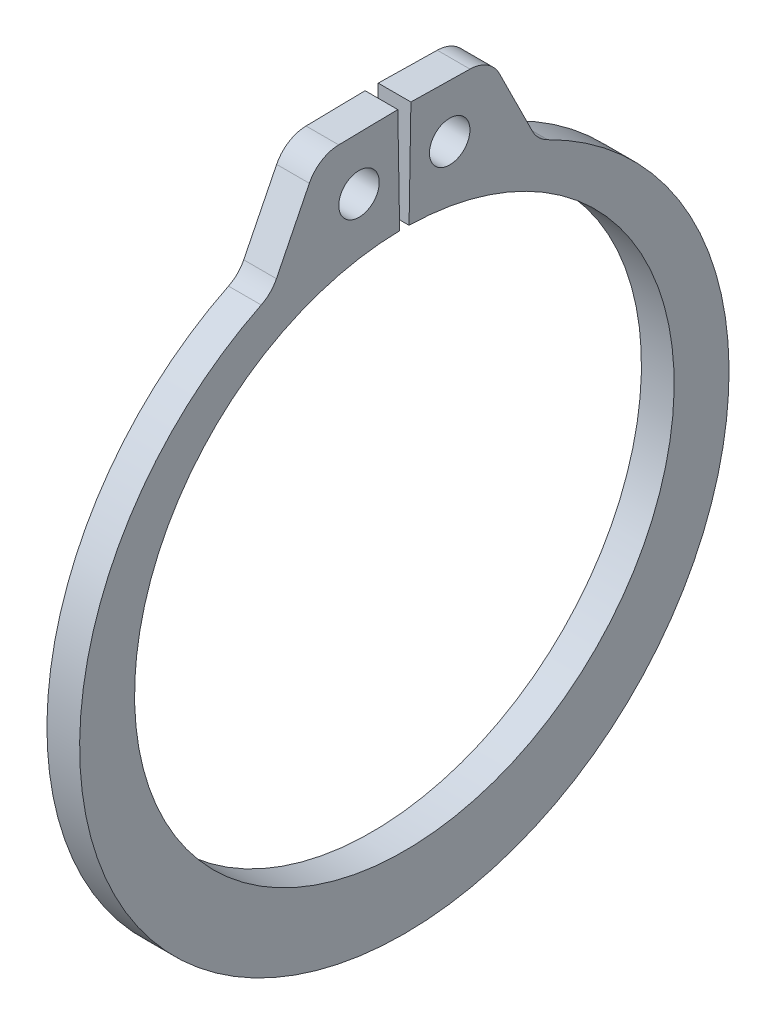
ISO-10303-21;
HEADER;
FILE_DESCRIPTION(('STEP AP214'),'2;1');
FILE_NAME('part.step','',(''),(''),'','','');
FILE_SCHEMA(('AUTOMOTIVE_DESIGN { 1 0 10303 214 1 1 1 1 }'));
ENDSEC;
DATA;
#1=APPLICATION_CONTEXT('core data for automotive mechanical design processes');
#2=APPLICATION_PROTOCOL_DEFINITION('international standard','automotive_design',2000,#1);
#3=PRODUCT_CONTEXT('',#1,'mechanical');
#4=PRODUCT('Part','Part','',(#3));
#5=PRODUCT_RELATED_PRODUCT_CATEGORY('part','',(#4));
#6=PRODUCT_DEFINITION_FORMATION('','',#4);
#7=PRODUCT_DEFINITION_CONTEXT('part definition',#1,'design');
#8=PRODUCT_DEFINITION('design','',#6,#7);
#9=PRODUCT_DEFINITION_SHAPE('','',#8);
#10=(LENGTH_UNIT() NAMED_UNIT(*) SI_UNIT(.MILLI.,.METRE.));
#11=(NAMED_UNIT(*) PLANE_ANGLE_UNIT() SI_UNIT($,.RADIAN.));
#12=(NAMED_UNIT(*) SI_UNIT($,.STERADIAN.) SOLID_ANGLE_UNIT());
#13=UNCERTAINTY_MEASURE_WITH_UNIT(LENGTH_MEASURE(1.E-05),#10,'distance_accuracy_value','');
#14=(GEOMETRIC_REPRESENTATION_CONTEXT(3) GLOBAL_UNCERTAINTY_ASSIGNED_CONTEXT((#13)) GLOBAL_UNIT_ASSIGNED_CONTEXT((#10,
#11,#12)) REPRESENTATION_CONTEXT('',''));
#15=CARTESIAN_POINT('',(0.,0.,0.));
#16=DIRECTION('',(0.,0.,1.));
#17=DIRECTION('',(1.,0.,0.));
#18=AXIS2_PLACEMENT_3D('',#15,#16,#17);
#19=CARTESIAN_POINT('',(0.533399999999989,0.,0.));
#20=DIRECTION('',(1.,0.,0.));
#21=DIRECTION('',(0.,0.,-1.));
#22=AXIS2_PLACEMENT_3D('',#19,#20,#21);
#23=PLANE('',#22);
#24=CARTESIAN_POINT('',(0.533399999999989,10.5040886416162,-1.47894687499924));
#25=DIRECTION('',(-1.,0.,0.));
#26=DIRECTION('',(0.,0.,1.));
#27=AXIS2_PLACEMENT_3D('',#24,#25,#26);
#28=CIRCLE('',#27,0.6604);
#29=CARTESIAN_POINT('',(0.533399999999989,10.5040886416162,-0.818546874999241));
#30=VERTEX_POINT('',#29);
#31=EDGE_CURVE('E108',#30,#30,#28,.T.);
#32=ORIENTED_EDGE('',*,*,#31,.T.);
#33=EDGE_LOOP('',(#32));
#34=FACE_BOUND('',#33,.T.);
#35=CARTESIAN_POINT('',(0.533399999999989,0.,0.));
#36=DIRECTION('',(-1.,0.,0.));
#37=DIRECTION('',(0.,0.,1.));
#38=AXIS2_PLACEMENT_3D('',#35,#36,#37);
#39=CIRCLE('',#38,8.8011);
#40=CARTESIAN_POINT('',(0.533399999999989,8.79975954984091,-0.153600374295177));
#41=VERTEX_POINT('',#40);
#42=CARTESIAN_POINT('',(0.533399999999989,8.79975954984091,0.153600374295175));
#43=VERTEX_POINT('',#42);
#44=EDGE_CURVE('E174',#41,#43,#39,.T.);
#45=ORIENTED_EDGE('',*,*,#44,.T.);
#46=DIRECTION('',(0.,-0.999847695156391,-0.0174524064372834));
#47=VECTOR('',#46,1.);
#48=CARTESIAN_POINT('',(0.533399999999989,8.79975954984091,0.153600374295175));
#49=LINE('',#48,#47);
#50=CARTESIAN_POINT('',(0.533399999999989,12.2536334279892,0.213887967092126));
#51=VERTEX_POINT('',#50);
#52=EDGE_CURVE('E124',#43,#51,#49,.F.);
#53=ORIENTED_EDGE('',*,*,#52,.T.);
#54=DIRECTION('',(0.,0.0174524064372834,-0.999847695156391));
#55=VECTOR('',#54,1.);
#56=CARTESIAN_POINT('',(0.533399999999989,12.2536334279892,0.213887967092126));
#57=LINE('',#56,#55);
#58=CARTESIAN_POINT('',(0.533399999999989,12.21999978275,2.14075821234738));
#59=VERTEX_POINT('',#58);
#60=EDGE_CURVE('E119',#51,#59,#57,.F.);
#61=ORIENTED_EDGE('',*,*,#60,.T.);
#62=CARTESIAN_POINT('',(0.533399999999989,11.1279661301002,2.12169669403658));
#63=DIRECTION('',(-1.,0.,0.));
#64=DIRECTION('',(0.,0.,1.));
#65=AXIS2_PLACEMENT_3D('',#62,#63,#64);
#66=CIRCLE('',#65,1.0922);
#67=CARTESIAN_POINT('',(0.533399999999989,11.6141614114107,3.09971253666458));
#68=VERTEX_POINT('',#67);
#69=EDGE_CURVE('E112',#68,#59,#66,.T.);
#70=ORIENTED_EDGE('',*,*,#69,.F.);
#71=DIRECTION('',(0.,0.895454900776411,-0.445152244378829));
#72=VECTOR('',#71,1.);
#73=CARTESIAN_POINT('',(0.533399999999989,12.2084177333914,2.80429337570331));
#74=LINE('',#73,#72);
#75=CARTESIAN_POINT('',(0.533399999999989,9.45539137797145,4.17288922557434));
#76=VERTEX_POINT('',#75);
#77=EDGE_CURVE('E107',#68,#76,#74,.F.);
#78=ORIENTED_EDGE('',*,*,#77,.T.);
#79=CARTESIAN_POINT('',(0.533399999999989,9.941586659282,5.15090506820234));
#80=DIRECTION('',(-1.,0.,0.));
#81=DIRECTION('',(0.,0.,1.));
#82=AXIS2_PLACEMENT_3D('',#79,#80,#81);
#83=CIRCLE('',#82,1.0922);
#84=CARTESIAN_POINT('',(0.533399999999989,8.96124610534802,4.66941442622431));
#85=VERTEX_POINT('',#84);
#86=EDGE_CURVE('E98',#76,#85,#83,.T.);
#87=ORIENTED_EDGE('',*,*,#86,.T.);
#88=CARTESIAN_POINT('',(0.533399999999989,-0.545929997486656,0.));
#89=DIRECTION('',(-1.,0.,0.));
#90=DIRECTION('',(0.,0.,1.));
#91=AXIS2_PLACEMENT_3D('',#88,#89,#90);
#92=CIRCLE('',#91,10.5919700025133);
#93=CARTESIAN_POINT('',(0.533399999999989,8.96124610534802,-4.66941442622431));
#94=VERTEX_POINT('',#93);
#95=EDGE_CURVE('E181',#94,#85,#92,.T.);
#96=ORIENTED_EDGE('',*,*,#95,.F.);
#97=CARTESIAN_POINT('',(0.533399999999989,9.941586659282,-5.15090506820234));
#98=DIRECTION('',(-1.,0.,0.));
#99=DIRECTION('',(0.,0.,1.));
#100=AXIS2_PLACEMENT_3D('',#97,#98,#99);
#101=CIRCLE('',#100,1.0922);
#102=CARTESIAN_POINT('',(0.533399999999989,9.45539137797145,-4.17288922557434));
#103=VERTEX_POINT('',#102);
#104=EDGE_CURVE('E178',#94,#103,#101,.T.);
#105=ORIENTED_EDGE('',*,*,#104,.T.);
#106=DIRECTION('',(0.,-0.895454900776411,-0.445152244378829));
#107=VECTOR('',#106,1.);
#108=CARTESIAN_POINT('',(0.533399999999989,12.2084177333914,-2.80429337570331));
#109=LINE('',#108,#107);
#110=CARTESIAN_POINT('',(0.533399999999989,11.6141614114107,-3.09971253666458));
#111=VERTEX_POINT('',#110);
#112=EDGE_CURVE('E143',#103,#111,#109,.F.);
#113=ORIENTED_EDGE('',*,*,#112,.T.);
#114=CARTESIAN_POINT('',(0.533399999999989,11.1279661301002,-2.12169669403658));
#115=DIRECTION('',(-1.,0.,0.));
#116=DIRECTION('',(0.,0.,1.));
#117=AXIS2_PLACEMENT_3D('',#114,#115,#116);
#118=CIRCLE('',#117,1.0922);
#119=CARTESIAN_POINT('',(0.533399999999989,12.21999978275,-2.14075821234738));
#120=VERTEX_POINT('',#119);
#121=EDGE_CURVE('E145',#120,#111,#118,.T.);
#122=ORIENTED_EDGE('',*,*,#121,.F.);
#123=DIRECTION('',(0.,-0.0174524064372835,-0.999847695156391));
#124=VECTOR('',#123,1.);
#125=CARTESIAN_POINT('',(0.533399999999989,12.2536334279892,-0.213887967092127));
#126=LINE('',#125,#124);
#127=CARTESIAN_POINT('',(0.533399999999989,12.2536334279892,-0.213887967092128));
#128=VERTEX_POINT('',#127);
#129=EDGE_CURVE('E137',#120,#128,#126,.F.);
#130=ORIENTED_EDGE('',*,*,#129,.T.);
#131=DIRECTION('',(0.,0.999847695156391,-0.0174524064372835));
#132=VECTOR('',#131,1.);
#133=CARTESIAN_POINT('',(0.533399999999989,8.79975954984091,-0.153600374295177));
#134=LINE('',#133,#132);
#135=EDGE_CURVE('E130',#128,#41,#134,.F.);
#136=ORIENTED_EDGE('',*,*,#135,.T.);
#137=EDGE_LOOP('',(#45,#53,#61,#70,#78,#87,#96,#105,#113,#122,#130,#136));
#138=FACE_BOUND('',#137,.T.);
#139=CARTESIAN_POINT('',(0.533399999999989,10.5040886416162,1.47894687499924));
#140=DIRECTION('',(-1.,0.,0.));
#141=DIRECTION('',(0.,0.,1.));
#142=AXIS2_PLACEMENT_3D('',#139,#140,#141);
#143=CIRCLE('',#142,0.6604);
#144=CARTESIAN_POINT('',(0.533399999999989,10.5040886416162,2.13934687499924));
#145=VERTEX_POINT('',#144);
#146=EDGE_CURVE('E20',#145,#145,#143,.T.);
#147=ORIENTED_EDGE('',*,*,#146,.T.);
#148=EDGE_LOOP('',(#147));
#149=FACE_BOUND('',#148,.T.);
#150=ADVANCED_FACE('F17',(#34,#138,#149),#23,.T.);
#151=CARTESIAN_POINT('',(0.533399999999989,10.5040886416162,1.47894687499924));
#152=DIRECTION('',(-1.,0.,0.));
#153=DIRECTION('',(0.,0.,1.));
#154=AXIS2_PLACEMENT_3D('',#151,#152,#153);
#155=CYLINDRICAL_SURFACE('',#154,0.6604);
#156=CARTESIAN_POINT('',(-0.533399999999989,10.5040886416162,1.47894687499924));
#157=DIRECTION('',(-1.,0.,0.));
#158=DIRECTION('',(0.,0.,1.));
#159=AXIS2_PLACEMENT_3D('',#156,#157,#158);
#160=CIRCLE('',#159,0.6604);
#161=CARTESIAN_POINT('',(-0.533399999999989,10.5040886416162,2.13934687499924));
#162=VERTEX_POINT('',#161);
#163=EDGE_CURVE('E168',#162,#162,#160,.T.);
#164=ORIENTED_EDGE('',*,*,#163,.T.);
#165=EDGE_LOOP('',(#164));
#166=FACE_BOUND('',#165,.T.);
#167=ORIENTED_EDGE('',*,*,#146,.F.);
#168=EDGE_LOOP('',(#167));
#169=FACE_BOUND('',#168,.T.);
#170=ADVANCED_FACE('F388',(#166,#169),#155,.F.);
#171=CARTESIAN_POINT('',(0.533399999999989,9.941586659282,5.15090506820234));
#172=DIRECTION('',(-1.,0.,0.));
#173=DIRECTION('',(0.,0.,1.));
#174=AXIS2_PLACEMENT_3D('',#171,#172,#173);
#175=CYLINDRICAL_SURFACE('',#174,1.0922);
#176=DIRECTION('',(1.,0.,0.));
#177=VECTOR('',#176,1.);
#178=CARTESIAN_POINT('',(0.533399999999989,9.45539137797145,4.17288922557434));
#179=LINE('',#178,#177);
#180=CARTESIAN_POINT('',(-0.533399999999989,9.45539137797145,4.17288922557434));
#181=VERTEX_POINT('',#180);
#182=EDGE_CURVE('E102',#76,#181,#179,.F.);
#183=ORIENTED_EDGE('',*,*,#182,.T.);
#184=CARTESIAN_POINT('',(-0.533399999999989,9.941586659282,5.15090506820234));
#185=DIRECTION('',(-1.,0.,0.));
#186=DIRECTION('',(0.,0.,1.));
#187=AXIS2_PLACEMENT_3D('',#184,#185,#186);
#188=CIRCLE('',#187,1.0922);
#189=CARTESIAN_POINT('',(-0.533399999999989,8.96124610534802,4.66941442622431));
#190=VERTEX_POINT('',#189);
#191=EDGE_CURVE('E166',#181,#190,#188,.T.);
#192=ORIENTED_EDGE('',*,*,#191,.T.);
#193=DIRECTION('',(-1.,0.,0.));
#194=VECTOR('',#193,1.);
#195=CARTESIAN_POINT('',(0.533399999999989,8.96124610534802,4.66941442622431));
#196=LINE('',#195,#194);
#197=EDGE_CURVE('E103',#85,#190,#196,.T.);
#198=ORIENTED_EDGE('',*,*,#197,.F.);
#199=ORIENTED_EDGE('',*,*,#86,.F.);
#200=EDGE_LOOP('',(#183,#192,#198,#199));
#201=FACE_BOUND('',#200,.T.);
#202=ADVANCED_FACE('F100',(#201),#175,.F.);
#203=CARTESIAN_POINT('',(0.533399999999989,-0.545929997486656,0.));
#204=DIRECTION('',(-1.,0.,0.));
#205=DIRECTION('',(0.,0.,1.));
#206=AXIS2_PLACEMENT_3D('',#203,#204,#205);
#207=CYLINDRICAL_SURFACE('',#206,10.5919700025133);
#208=CARTESIAN_POINT('',(-0.533399999999989,-0.545929997486656,0.));
#209=DIRECTION('',(-1.,0.,0.));
#210=DIRECTION('',(0.,0.,1.));
#211=AXIS2_PLACEMENT_3D('',#208,#209,#210);
#212=CIRCLE('',#211,10.5919700025133);
#213=CARTESIAN_POINT('',(-0.533399999999989,8.96124610534802,-4.66941442622431));
#214=VERTEX_POINT('',#213);
#215=EDGE_CURVE('E164',#190,#214,#212,.F.);
#216=ORIENTED_EDGE('',*,*,#215,.T.);
#217=DIRECTION('',(-1.,0.,0.));
#218=VECTOR('',#217,1.);
#219=CARTESIAN_POINT('',(0.533399999999989,8.96124610534802,-4.66941442622431));
#220=LINE('',#219,#218);
#221=EDGE_CURVE('E180',#214,#94,#220,.F.);
#222=ORIENTED_EDGE('',*,*,#221,.T.);
#223=ORIENTED_EDGE('',*,*,#95,.T.);
#224=ORIENTED_EDGE('',*,*,#197,.T.);
#225=EDGE_LOOP('',(#216,#222,#223,#224));
#226=FACE_BOUND('',#225,.T.);
#227=ADVANCED_FACE('F186',(#226),#207,.T.);
#228=CARTESIAN_POINT('',(0.533399999999989,9.941586659282,-5.15090506820234));
#229=DIRECTION('',(-1.,0.,0.));
#230=DIRECTION('',(0.,0.,1.));
#231=AXIS2_PLACEMENT_3D('',#228,#229,#230);
#232=CYLINDRICAL_SURFACE('',#231,1.0922);
#233=ORIENTED_EDGE('',*,*,#221,.F.);
#234=CARTESIAN_POINT('',(-0.533399999999989,9.941586659282,-5.15090506820234));
#235=DIRECTION('',(-1.,0.,0.));
#236=DIRECTION('',(0.,0.,1.));
#237=AXIS2_PLACEMENT_3D('',#234,#235,#236);
#238=CIRCLE('',#237,1.0922);
#239=CARTESIAN_POINT('',(-0.533399999999989,9.45539137797145,-4.17288922557434));
#240=VERTEX_POINT('',#239);
#241=EDGE_CURVE('E161',#214,#240,#238,.T.);
#242=ORIENTED_EDGE('',*,*,#241,.T.);
#243=DIRECTION('',(1.,0.,0.));
#244=VECTOR('',#243,1.);
#245=CARTESIAN_POINT('',(0.533399999999989,9.45539137797145,-4.17288922557434));
#246=LINE('',#245,#244);
#247=EDGE_CURVE('E146',#240,#103,#246,.T.);
#248=ORIENTED_EDGE('',*,*,#247,.T.);
#249=ORIENTED_EDGE('',*,*,#104,.F.);
#250=EDGE_LOOP('',(#233,#242,#248,#249));
#251=FACE_BOUND('',#250,.T.);
#252=ADVANCED_FACE('F198',(#251),#232,.F.);
#253=CARTESIAN_POINT('',(0.533399999999989,12.2084177333914,-2.80429337570331));
#254=DIRECTION('',(0.,-0.445152244378829,0.895454900776411));
#255=DIRECTION('',(0.,-0.895454900776411,-0.445152244378829));
#256=AXIS2_PLACEMENT_3D('',#253,#254,#255);
#257=PLANE('',#256);
#258=ORIENTED_EDGE('',*,*,#247,.F.);
#259=DIRECTION('',(0.,0.89545490077641,0.445152244378829));
#260=VECTOR('',#259,1.);
#261=CARTESIAN_POINT('',(-0.533399999999989,9.45539137797145,-4.17288922557434));
#262=LINE('',#261,#260);
#263=CARTESIAN_POINT('',(-0.533399999999989,11.6141614114107,-3.09971253666458));
#264=VERTEX_POINT('',#263);
#265=EDGE_CURVE('E160',#240,#264,#262,.T.);
#266=ORIENTED_EDGE('',*,*,#265,.T.);
#267=DIRECTION('',(-1.,0.,0.));
#268=VECTOR('',#267,1.);
#269=CARTESIAN_POINT('',(0.533399999999989,11.6141614114107,-3.09971253666458));
#270=LINE('',#269,#268);
#271=EDGE_CURVE('E177',#111,#264,#270,.T.);
#272=ORIENTED_EDGE('',*,*,#271,.F.);
#273=ORIENTED_EDGE('',*,*,#112,.F.);
#274=EDGE_LOOP('',(#258,#266,#272,#273));
#275=FACE_BOUND('',#274,.T.);
#276=ADVANCED_FACE('F203',(#275),#257,.F.);
#277=CARTESIAN_POINT('',(0.533399999999989,11.1279661301002,-2.12169669403658));
#278=DIRECTION('',(-1.,0.,0.));
#279=DIRECTION('',(0.,0.,1.));
#280=AXIS2_PLACEMENT_3D('',#277,#278,#279);
#281=CYLINDRICAL_SURFACE('',#280,1.0922);
#282=CARTESIAN_POINT('',(-0.533399999999989,11.1279661301002,-2.12169669403658));
#283=DIRECTION('',(-1.,0.,0.));
#284=DIRECTION('',(0.,0.,1.));
#285=AXIS2_PLACEMENT_3D('',#282,#283,#284);
#286=CIRCLE('',#285,1.0922);
#287=CARTESIAN_POINT('',(-0.533399999999989,12.21999978275,-2.14075821234738));
#288=VERTEX_POINT('',#287);
#289=EDGE_CURVE('E156',#264,#288,#286,.F.);
#290=ORIENTED_EDGE('',*,*,#289,.T.);
#291=DIRECTION('',(1.,0.,0.));
#292=VECTOR('',#291,1.);
#293=CARTESIAN_POINT('',(0.533399999999989,12.21999978275,-2.14075821234738));
#294=LINE('',#293,#292);
#295=EDGE_CURVE('E140',#288,#120,#294,.T.);
#296=ORIENTED_EDGE('',*,*,#295,.T.);
#297=ORIENTED_EDGE('',*,*,#121,.T.);
#298=ORIENTED_EDGE('',*,*,#271,.T.);
#299=EDGE_LOOP('',(#290,#296,#297,#298));
#300=FACE_BOUND('',#299,.T.);
#301=ADVANCED_FACE('F266',(#300),#281,.T.);
#302=CARTESIAN_POINT('',(0.533399999999989,12.2536334279892,-0.213887967092127));
#303=DIRECTION('',(0.,-0.999847695156391,0.0174524064372835));
#304=DIRECTION('',(0.,-0.0174524064372835,-0.999847695156391));
#305=AXIS2_PLACEMENT_3D('',#302,#303,#304);
#306=PLANE('',#305);
#307=ORIENTED_EDGE('',*,*,#295,.F.);
#308=DIRECTION('',(0.,0.0174524064372837,0.999847695156391));
#309=VECTOR('',#308,1.);
#310=CARTESIAN_POINT('',(-0.533399999999989,12.21999978275,-2.14075821234738));
#311=LINE('',#310,#309);
#312=CARTESIAN_POINT('',(-0.533399999999989,12.2536334279892,-0.213887967092128));
#313=VERTEX_POINT('',#312);
#314=EDGE_CURVE('E159',#288,#313,#311,.T.);
#315=ORIENTED_EDGE('',*,*,#314,.T.);
#316=DIRECTION('',(1.,0.,0.));
#317=VECTOR('',#316,1.);
#318=CARTESIAN_POINT('',(0.533399999999989,12.2536334279892,-0.213887967092129));
#319=LINE('',#318,#317);
#320=EDGE_CURVE('E134',#313,#128,#319,.T.);
#321=ORIENTED_EDGE('',*,*,#320,.T.);
#322=ORIENTED_EDGE('',*,*,#129,.F.);
#323=EDGE_LOOP('',(#307,#315,#321,#322));
#324=FACE_BOUND('',#323,.T.);
#325=ADVANCED_FACE('F264',(#324),#306,.F.);
#326=CARTESIAN_POINT('',(0.533399999999989,8.79975954984091,-0.153600374295177));
#327=DIRECTION('',(0.,-0.0174524064372835,-0.999847695156391));
#328=DIRECTION('',(0.,0.999847695156391,-0.0174524064372835));
#329=AXIS2_PLACEMENT_3D('',#326,#327,#328);
#330=PLANE('',#329);
#331=DIRECTION('',(-1.,0.,0.));
#332=VECTOR('',#331,1.);
#333=CARTESIAN_POINT('',(0.533399999999989,8.79975954984091,-0.153600374295178));
#334=LINE('',#333,#332);
#335=CARTESIAN_POINT('',(-0.533399999999989,8.79975954984091,-0.153600374295177));
#336=VERTEX_POINT('',#335);
#337=EDGE_CURVE('E133',#336,#41,#334,.F.);
#338=ORIENTED_EDGE('',*,*,#337,.T.);
#339=ORIENTED_EDGE('',*,*,#135,.F.);
#340=ORIENTED_EDGE('',*,*,#320,.F.);
#341=DIRECTION('',(0.,-0.999847695156391,0.017452406437283));
#342=VECTOR('',#341,1.);
#343=CARTESIAN_POINT('',(-0.533399999999989,12.2536334279892,-0.213887967092127));
#344=LINE('',#343,#342);
#345=EDGE_CURVE('E155',#313,#336,#344,.T.);
#346=ORIENTED_EDGE('',*,*,#345,.T.);
#347=EDGE_LOOP('',(#338,#339,#340,#346));
#348=FACE_BOUND('',#347,.T.);
#349=ADVANCED_FACE('F259',(#348),#330,.F.);
#350=CARTESIAN_POINT('',(0.533399999999989,0.,0.));
#351=DIRECTION('',(-1.,0.,0.));
#352=DIRECTION('',(0.,0.,1.));
#353=AXIS2_PLACEMENT_3D('',#350,#351,#352);
#354=CYLINDRICAL_SURFACE('',#353,8.8011);
#355=ORIENTED_EDGE('',*,*,#44,.F.);
#356=ORIENTED_EDGE('',*,*,#337,.F.);
#357=CARTESIAN_POINT('',(-0.533399999999989,0.,0.));
#358=DIRECTION('',(-1.,0.,0.));
#359=DIRECTION('',(0.,0.,1.));
#360=AXIS2_PLACEMENT_3D('',#357,#358,#359);
#361=CIRCLE('',#360,8.8011);
#362=CARTESIAN_POINT('',(-0.533399999999989,8.79975954984091,0.153600374295175));
#363=VERTEX_POINT('',#362);
#364=EDGE_CURVE('E152',#336,#363,#361,.T.);
#365=ORIENTED_EDGE('',*,*,#364,.T.);
#366=DIRECTION('',(1.,0.,0.));
#367=VECTOR('',#366,1.);
#368=CARTESIAN_POINT('',(0.533399999999989,8.79975954984091,0.153600374295175));
#369=LINE('',#368,#367);
#370=EDGE_CURVE('E127',#363,#43,#369,.T.);
#371=ORIENTED_EDGE('',*,*,#370,.T.);
#372=EDGE_LOOP('',(#355,#356,#365,#371));
#373=FACE_BOUND('',#372,.T.);
#374=ADVANCED_FACE('F254',(#373),#354,.F.);
#375=CARTESIAN_POINT('',(0.533399999999989,8.79975954984091,0.153600374295175));
#376=DIRECTION('',(0.,-0.0174524064372834,0.999847695156391));
#377=DIRECTION('',(0.,-0.999847695156391,-0.0174524064372834));
#378=AXIS2_PLACEMENT_3D('',#375,#376,#377);
#379=PLANE('',#378);
#380=DIRECTION('',(1.,0.,0.));
#381=VECTOR('',#380,1.);
#382=CARTESIAN_POINT('',(0.533399999999989,12.2536334279892,0.213887967092126));
#383=LINE('',#382,#381);
#384=CARTESIAN_POINT('',(-0.533399999999989,12.2536334279892,0.213887967092126));
#385=VERTEX_POINT('',#384);
#386=EDGE_CURVE('E121',#385,#51,#383,.T.);
#387=ORIENTED_EDGE('',*,*,#386,.T.);
#388=ORIENTED_EDGE('',*,*,#52,.F.);
#389=ORIENTED_EDGE('',*,*,#370,.F.);
#390=DIRECTION('',(0.,0.999847695156391,0.0174524064372833));
#391=VECTOR('',#390,1.);
#392=CARTESIAN_POINT('',(-0.533399999999989,8.79975954984091,0.153600374295175));
#393=LINE('',#392,#391);
#394=EDGE_CURVE('E154',#363,#385,#393,.T.);
#395=ORIENTED_EDGE('',*,*,#394,.T.);
#396=EDGE_LOOP('',(#387,#388,#389,#395));
#397=FACE_BOUND('',#396,.T.);
#398=ADVANCED_FACE('F251',(#397),#379,.F.);
#399=CARTESIAN_POINT('',(0.533399999999989,12.2536334279892,0.213887967092126));
#400=DIRECTION('',(0.,-0.999847695156391,-0.0174524064372834));
#401=DIRECTION('',(0.,0.0174524064372834,-0.999847695156391));
#402=AXIS2_PLACEMENT_3D('',#399,#400,#401);
#403=PLANE('',#402);
#404=DIRECTION('',(-1.,0.,0.));
#405=VECTOR('',#404,1.);
#406=CARTESIAN_POINT('',(0.533399999999989,12.21999978275,2.14075821234738));
#407=LINE('',#406,#405);
#408=CARTESIAN_POINT('',(-0.533399999999989,12.21999978275,2.14075821234738));
#409=VERTEX_POINT('',#408);
#410=EDGE_CURVE('E114',#59,#409,#407,.T.);
#411=ORIENTED_EDGE('',*,*,#410,.F.);
#412=ORIENTED_EDGE('',*,*,#60,.F.);
#413=ORIENTED_EDGE('',*,*,#386,.F.);
#414=DIRECTION('',(0.,-0.0174524064372828,0.999847695156391));
#415=VECTOR('',#414,1.);
#416=CARTESIAN_POINT('',(-0.533399999999989,12.2536334279892,0.213887967092126));
#417=LINE('',#416,#415);
#418=EDGE_CURVE('E151',#385,#409,#417,.T.);
#419=ORIENTED_EDGE('',*,*,#418,.T.);
#420=EDGE_LOOP('',(#411,#412,#413,#419));
#421=FACE_BOUND('',#420,.T.);
#422=ADVANCED_FACE('F244',(#421),#403,.F.);
#423=CARTESIAN_POINT('',(0.533399999999989,11.1279661301002,2.12169669403658));
#424=DIRECTION('',(-1.,0.,0.));
#425=DIRECTION('',(0.,0.,1.));
#426=AXIS2_PLACEMENT_3D('',#423,#424,#425);
#427=CYLINDRICAL_SURFACE('',#426,1.0922);
#428=CARTESIAN_POINT('',(-0.533399999999989,11.1279661301002,2.12169669403658));
#429=DIRECTION('',(-1.,0.,0.));
#430=DIRECTION('',(0.,0.,1.));
#431=AXIS2_PLACEMENT_3D('',#428,#429,#430);
#432=CIRCLE('',#431,1.0922);
#433=CARTESIAN_POINT('',(-0.533399999999989,11.6141614114107,3.09971253666458));
#434=VERTEX_POINT('',#433);
#435=EDGE_CURVE('E148',#409,#434,#432,.F.);
#436=ORIENTED_EDGE('',*,*,#435,.T.);
#437=DIRECTION('',(1.,0.,0.));
#438=VECTOR('',#437,1.);
#439=CARTESIAN_POINT('',(0.533399999999989,11.6141614114107,3.09971253666458));
#440=LINE('',#439,#438);
#441=EDGE_CURVE('E35',#434,#68,#440,.T.);
#442=ORIENTED_EDGE('',*,*,#441,.T.);
#443=ORIENTED_EDGE('',*,*,#69,.T.);
#444=ORIENTED_EDGE('',*,*,#410,.T.);
#445=EDGE_LOOP('',(#436,#442,#443,#444));
#446=FACE_BOUND('',#445,.T.);
#447=ADVANCED_FACE('F289',(#446),#427,.T.);
#448=CARTESIAN_POINT('',(0.533399999999989,12.2084177333914,2.80429337570331));
#449=DIRECTION('',(0.,-0.445152244378829,-0.895454900776411));
#450=DIRECTION('',(0.,0.895454900776411,-0.445152244378829));
#451=AXIS2_PLACEMENT_3D('',#448,#449,#450);
#452=PLANE('',#451);
#453=ORIENTED_EDGE('',*,*,#182,.F.);
#454=ORIENTED_EDGE('',*,*,#77,.F.);
#455=ORIENTED_EDGE('',*,*,#441,.F.);
#456=DIRECTION('',(0.,-0.895454900776411,0.445152244378828));
#457=VECTOR('',#456,1.);
#458=CARTESIAN_POINT('',(-0.533399999999989,11.6141614114107,3.09971253666458));
#459=LINE('',#458,#457);
#460=EDGE_CURVE('E26',#434,#181,#459,.T.);
#461=ORIENTED_EDGE('',*,*,#460,.T.);
#462=EDGE_LOOP('',(#453,#454,#455,#461));
#463=FACE_BOUND('',#462,.T.);
#464=ADVANCED_FACE('F106',(#463),#452,.F.);
#465=CARTESIAN_POINT('',(0.533399999999989,10.5040886416162,-1.47894687499924));
#466=DIRECTION('',(-1.,0.,0.));
#467=DIRECTION('',(0.,0.,1.));
#468=AXIS2_PLACEMENT_3D('',#465,#466,#467);
#469=CYLINDRICAL_SURFACE('',#468,0.6604);
#470=CARTESIAN_POINT('',(-0.533399999999989,10.5040886416162,-1.47894687499924));
#471=DIRECTION('',(-1.,0.,0.));
#472=DIRECTION('',(0.,0.,1.));
#473=AXIS2_PLACEMENT_3D('',#470,#471,#472);
#474=CIRCLE('',#473,0.6604);
#475=CARTESIAN_POINT('',(-0.533399999999989,10.5040886416162,-0.818546874999241));
#476=VERTEX_POINT('',#475);
#477=EDGE_CURVE('E11',#476,#476,#474,.T.);
#478=ORIENTED_EDGE('',*,*,#477,.T.);
#479=EDGE_LOOP('',(#478));
#480=FACE_BOUND('',#479,.T.);
#481=ORIENTED_EDGE('',*,*,#31,.F.);
#482=EDGE_LOOP('',(#481));
#483=FACE_BOUND('',#482,.T.);
#484=ADVANCED_FACE('F277',(#480,#483),#469,.F.);
#485=CARTESIAN_POINT('',(-0.533399999999989,0.,0.));
#486=DIRECTION('',(1.,0.,0.));
#487=DIRECTION('',(0.,0.,-1.));
#488=AXIS2_PLACEMENT_3D('',#485,#486,#487);
#489=PLANE('',#488);
#490=ORIENTED_EDGE('',*,*,#477,.F.);
#491=EDGE_LOOP('',(#490));
#492=FACE_BOUND('',#491,.T.);
#493=ORIENTED_EDGE('',*,*,#435,.F.);
#494=ORIENTED_EDGE('',*,*,#418,.F.);
#495=ORIENTED_EDGE('',*,*,#394,.F.);
#496=ORIENTED_EDGE('',*,*,#364,.F.);
#497=ORIENTED_EDGE('',*,*,#345,.F.);
#498=ORIENTED_EDGE('',*,*,#314,.F.);
#499=ORIENTED_EDGE('',*,*,#289,.F.);
#500=ORIENTED_EDGE('',*,*,#265,.F.);
#501=ORIENTED_EDGE('',*,*,#241,.F.);
#502=ORIENTED_EDGE('',*,*,#215,.F.);
#503=ORIENTED_EDGE('',*,*,#191,.F.);
#504=ORIENTED_EDGE('',*,*,#460,.F.);
#505=EDGE_LOOP('',(#493,#494,#495,#496,#497,#498,#499,#500,#501,#502,#503,#504));
#506=FACE_BOUND('',#505,.T.);
#507=ORIENTED_EDGE('',*,*,#163,.F.);
#508=EDGE_LOOP('',(#507));
#509=FACE_BOUND('',#508,.T.);
#510=ADVANCED_FACE('F191',(#492,#506,#509),#489,.F.);
#511=CLOSED_SHELL('',(#150,#170,#202,#227,#252,#276,#301,#325,#349,#374,#398,#422,#447,#464,
#484,#510));
#512=MANIFOLD_SOLID_BREP('B1',#511);
#513=ADVANCED_BREP_SHAPE_REPRESENTATION('',(#18,#512),#14);
#514=SHAPE_DEFINITION_REPRESENTATION(#9,#513);
ENDSEC;
END-ISO-10303-21;
